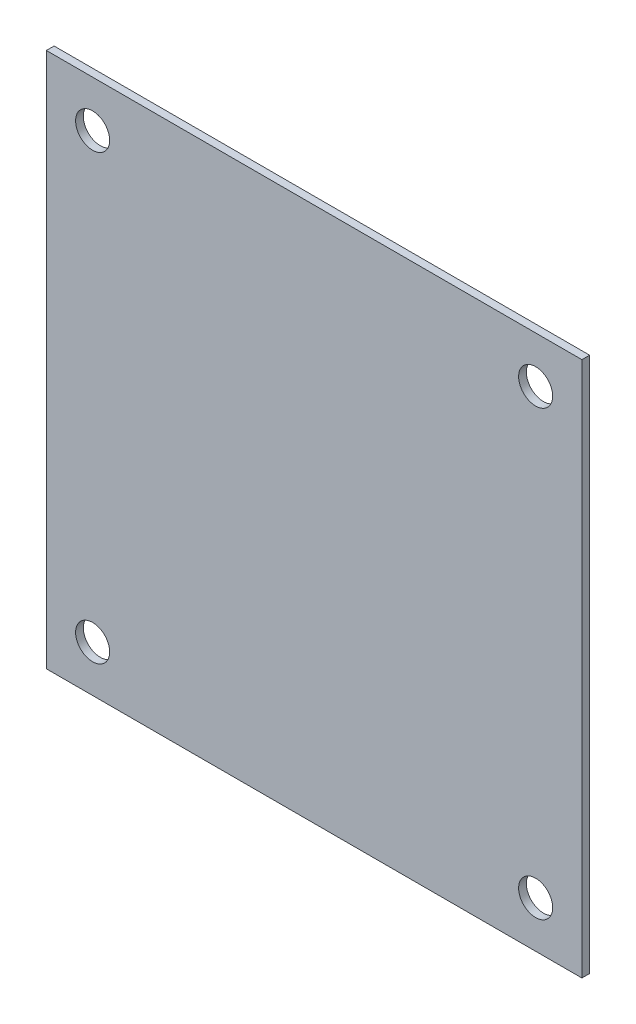
ISO-10303-21;
HEADER;
FILE_DESCRIPTION(('STEP AP214'),'2;1');
FILE_NAME('part.step','',(''),(''),'','','');
FILE_SCHEMA(('AUTOMOTIVE_DESIGN { 1 0 10303 214 1 1 1 1 }'));
ENDSEC;
DATA;
#1=APPLICATION_CONTEXT('core data for automotive mechanical design processes');
#2=APPLICATION_PROTOCOL_DEFINITION('international standard','automotive_design',2000,#1);
#3=PRODUCT_CONTEXT('',#1,'mechanical');
#4=PRODUCT('Part','Part','',(#3));
#5=PRODUCT_RELATED_PRODUCT_CATEGORY('part','',(#4));
#6=PRODUCT_DEFINITION_FORMATION('','',#4);
#7=PRODUCT_DEFINITION_CONTEXT('part definition',#1,'design');
#8=PRODUCT_DEFINITION('design','',#6,#7);
#9=PRODUCT_DEFINITION_SHAPE('','',#8);
#10=(LENGTH_UNIT() NAMED_UNIT(*) SI_UNIT(.MILLI.,.METRE.));
#11=(NAMED_UNIT(*) PLANE_ANGLE_UNIT() SI_UNIT($,.RADIAN.));
#12=(NAMED_UNIT(*) SI_UNIT($,.STERADIAN.) SOLID_ANGLE_UNIT());
#13=UNCERTAINTY_MEASURE_WITH_UNIT(LENGTH_MEASURE(1.E-05),#10,'distance_accuracy_value','');
#14=(GEOMETRIC_REPRESENTATION_CONTEXT(3) GLOBAL_UNCERTAINTY_ASSIGNED_CONTEXT((#13)) GLOBAL_UNIT_ASSIGNED_CONTEXT((#10,
#11,#12)) REPRESENTATION_CONTEXT('',''));
#15=CARTESIAN_POINT('',(0.,0.,0.));
#16=DIRECTION('',(0.,0.,1.));
#17=DIRECTION('',(1.,0.,0.));
#18=AXIS2_PLACEMENT_3D('',#15,#16,#17);
#19=CARTESIAN_POINT('',(0.,0.,1.5875));
#20=DIRECTION('',(0.,0.,-1.));
#21=DIRECTION('',(-1.,0.,0.));
#22=AXIS2_PLACEMENT_3D('',#19,#20,#21);
#23=PLANE('',#22);
#24=DIRECTION('',(1.,0.,0.));
#25=VECTOR('',#24,1.);
#26=CARTESIAN_POINT('',(93.5,-16.5,1.5875));
#27=LINE('',#26,#25);
#28=CARTESIAN_POINT('',(-16.5,-16.5,1.5875));
#29=VERTEX_POINT('',#28);
#30=CARTESIAN_POINT('',(93.5,-16.5,1.5875));
#31=VERTEX_POINT('',#30);
#32=EDGE_CURVE('E84',#29,#31,#27,.T.);
#33=ORIENTED_EDGE('',*,*,#32,.T.);
#34=DIRECTION('',(0.,1.,0.));
#35=VECTOR('',#34,1.);
#36=CARTESIAN_POINT('',(93.5,93.5,1.5875));
#37=LINE('',#36,#35);
#38=CARTESIAN_POINT('',(93.5,93.5,1.5875));
#39=VERTEX_POINT('',#38);
#40=EDGE_CURVE('E79',#31,#39,#37,.T.);
#41=ORIENTED_EDGE('',*,*,#40,.T.);
#42=DIRECTION('',(-1.,0.,0.));
#43=VECTOR('',#42,1.);
#44=CARTESIAN_POINT('',(-16.5,93.5,1.5875));
#45=LINE('',#44,#43);
#46=CARTESIAN_POINT('',(-16.5,93.5,1.5875));
#47=VERTEX_POINT('',#46);
#48=EDGE_CURVE('E82',#39,#47,#45,.T.);
#49=ORIENTED_EDGE('',*,*,#48,.T.);
#50=DIRECTION('',(0.,-1.,0.));
#51=VECTOR('',#50,1.);
#52=CARTESIAN_POINT('',(-16.5,-16.5,1.5875));
#53=LINE('',#52,#51);
#54=EDGE_CURVE('E49',#47,#29,#53,.T.);
#55=ORIENTED_EDGE('',*,*,#54,.T.);
#56=EDGE_LOOP('',(#33,#41,#49,#55));
#57=FACE_BOUND('',#56,.T.);
#58=CARTESIAN_POINT('',(84.,84.,1.5875));
#59=DIRECTION('',(0.,0.,1.));
#60=DIRECTION('',(1.,0.,0.));
#61=AXIS2_PLACEMENT_3D('',#58,#59,#60);
#62=CIRCLE('',#61,3.5);
#63=CARTESIAN_POINT('',(87.5,84.,1.5875));
#64=VERTEX_POINT('',#63);
#65=EDGE_CURVE('E99',#64,#64,#62,.T.);
#66=ORIENTED_EDGE('',*,*,#65,.F.);
#67=EDGE_LOOP('',(#66));
#68=FACE_BOUND('',#67,.T.);
#69=CARTESIAN_POINT('',(-7.00000000000002,84.,1.5875));
#70=DIRECTION('',(0.,0.,1.));
#71=DIRECTION('',(1.,0.,0.));
#72=AXIS2_PLACEMENT_3D('',#69,#70,#71);
#73=CIRCLE('',#72,3.5);
#74=CARTESIAN_POINT('',(-3.50000000000002,84.,1.5875));
#75=VERTEX_POINT('',#74);
#76=EDGE_CURVE('E114',#75,#75,#73,.T.);
#77=ORIENTED_EDGE('',*,*,#76,.F.);
#78=EDGE_LOOP('',(#77));
#79=FACE_BOUND('',#78,.T.);
#80=CARTESIAN_POINT('',(-7.,-7.,1.5875));
#81=DIRECTION('',(0.,0.,1.));
#82=DIRECTION('',(1.,0.,0.));
#83=AXIS2_PLACEMENT_3D('',#80,#81,#82);
#84=CIRCLE('',#83,3.5);
#85=CARTESIAN_POINT('',(-3.5,-7.,1.5875));
#86=VERTEX_POINT('',#85);
#87=EDGE_CURVE('E120',#86,#86,#84,.T.);
#88=ORIENTED_EDGE('',*,*,#87,.F.);
#89=EDGE_LOOP('',(#88));
#90=FACE_BOUND('',#89,.T.);
#91=CARTESIAN_POINT('',(84.,-7.,1.5875));
#92=DIRECTION('',(0.,0.,1.));
#93=DIRECTION('',(1.,0.,0.));
#94=AXIS2_PLACEMENT_3D('',#91,#92,#93);
#95=CIRCLE('',#94,3.5);
#96=CARTESIAN_POINT('',(87.5,-7.,1.5875));
#97=VERTEX_POINT('',#96);
#98=EDGE_CURVE('E126',#97,#97,#95,.T.);
#99=ORIENTED_EDGE('',*,*,#98,.F.);
#100=EDGE_LOOP('',(#99));
#101=FACE_BOUND('',#100,.T.);
#102=ADVANCED_FACE('F32',(#57,#68,#79,#90,#101),#23,.F.);
#103=CARTESIAN_POINT('',(0.,0.,0.));
#104=DIRECTION('',(0.,0.,-1.));
#105=DIRECTION('',(-1.,0.,0.));
#106=AXIS2_PLACEMENT_3D('',#103,#104,#105);
#107=PLANE('',#106);
#108=CARTESIAN_POINT('',(-7.,-7.,0.));
#109=DIRECTION('',(0.,0.,1.));
#110=DIRECTION('',(1.,0.,0.));
#111=AXIS2_PLACEMENT_3D('',#108,#109,#110);
#112=CIRCLE('',#111,3.5);
#113=CARTESIAN_POINT('',(-3.5,-7.,0.));
#114=VERTEX_POINT('',#113);
#115=EDGE_CURVE('E123',#114,#114,#112,.T.);
#116=ORIENTED_EDGE('',*,*,#115,.T.);
#117=EDGE_LOOP('',(#116));
#118=FACE_BOUND('',#117,.T.);
#119=CARTESIAN_POINT('',(84.,84.,0.));
#120=DIRECTION('',(0.,0.,1.));
#121=DIRECTION('',(1.,0.,0.));
#122=AXIS2_PLACEMENT_3D('',#119,#120,#121);
#123=CIRCLE('',#122,3.5);
#124=CARTESIAN_POINT('',(87.5,84.,0.));
#125=VERTEX_POINT('',#124);
#126=EDGE_CURVE('E111',#125,#125,#123,.T.);
#127=ORIENTED_EDGE('',*,*,#126,.T.);
#128=EDGE_LOOP('',(#127));
#129=FACE_BOUND('',#128,.T.);
#130=DIRECTION('',(1.,0.,0.));
#131=VECTOR('',#130,1.);
#132=CARTESIAN_POINT('',(93.5,-16.5,0.));
#133=LINE('',#132,#131);
#134=CARTESIAN_POINT('',(-16.5,-16.5,0.));
#135=VERTEX_POINT('',#134);
#136=CARTESIAN_POINT('',(93.5,-16.5,0.));
#137=VERTEX_POINT('',#136);
#138=EDGE_CURVE('E96',#135,#137,#133,.T.);
#139=ORIENTED_EDGE('',*,*,#138,.F.);
#140=DIRECTION('',(0.,-1.,0.));
#141=VECTOR('',#140,1.);
#142=CARTESIAN_POINT('',(-16.5,-16.5,0.));
#143=LINE('',#142,#141);
#144=CARTESIAN_POINT('',(-16.5,93.5,0.));
#145=VERTEX_POINT('',#144);
#146=EDGE_CURVE('E72',#145,#135,#143,.T.);
#147=ORIENTED_EDGE('',*,*,#146,.F.);
#148=DIRECTION('',(-1.,0.,0.));
#149=VECTOR('',#148,1.);
#150=CARTESIAN_POINT('',(-16.5,93.5,0.));
#151=LINE('',#150,#149);
#152=CARTESIAN_POINT('',(93.5,93.5,0.));
#153=VERTEX_POINT('',#152);
#154=EDGE_CURVE('E66',#153,#145,#151,.T.);
#155=ORIENTED_EDGE('',*,*,#154,.F.);
#156=DIRECTION('',(0.,1.,0.));
#157=VECTOR('',#156,1.);
#158=CARTESIAN_POINT('',(93.5,93.5,0.));
#159=LINE('',#158,#157);
#160=EDGE_CURVE('E88',#137,#153,#159,.T.);
#161=ORIENTED_EDGE('',*,*,#160,.F.);
#162=EDGE_LOOP('',(#139,#147,#155,#161));
#163=FACE_BOUND('',#162,.T.);
#164=CARTESIAN_POINT('',(-7.00000000000002,84.,0.));
#165=DIRECTION('',(0.,0.,1.));
#166=DIRECTION('',(1.,0.,0.));
#167=AXIS2_PLACEMENT_3D('',#164,#165,#166);
#168=CIRCLE('',#167,3.5);
#169=CARTESIAN_POINT('',(-3.50000000000002,84.,0.));
#170=VERTEX_POINT('',#169);
#171=EDGE_CURVE('E117',#170,#170,#168,.T.);
#172=ORIENTED_EDGE('',*,*,#171,.T.);
#173=EDGE_LOOP('',(#172));
#174=FACE_BOUND('',#173,.T.);
#175=CARTESIAN_POINT('',(84.,-7.,0.));
#176=DIRECTION('',(0.,0.,1.));
#177=DIRECTION('',(1.,0.,0.));
#178=AXIS2_PLACEMENT_3D('',#175,#176,#177);
#179=CIRCLE('',#178,3.5);
#180=CARTESIAN_POINT('',(87.5,-7.,0.));
#181=VERTEX_POINT('',#180);
#182=EDGE_CURVE('E129',#181,#181,#179,.T.);
#183=ORIENTED_EDGE('',*,*,#182,.T.);
#184=EDGE_LOOP('',(#183));
#185=FACE_BOUND('',#184,.T.);
#186=ADVANCED_FACE('F107',(#118,#129,#163,#174,#185),#107,.T.);
#187=CARTESIAN_POINT('',(93.5,-16.5,1.5875));
#188=DIRECTION('',(0.,1.,0.));
#189=DIRECTION('',(0.,0.,1.));
#190=AXIS2_PLACEMENT_3D('',#187,#188,#189);
#191=PLANE('',#190);
#192=ORIENTED_EDGE('',*,*,#138,.T.);
#193=DIRECTION('',(0.,0.,-1.));
#194=VECTOR('',#193,1.);
#195=CARTESIAN_POINT('',(93.5,-16.5,1.5875));
#196=LINE('',#195,#194);
#197=EDGE_CURVE('E11',#31,#137,#196,.T.);
#198=ORIENTED_EDGE('',*,*,#197,.F.);
#199=ORIENTED_EDGE('',*,*,#32,.F.);
#200=DIRECTION('',(0.,0.,-1.));
#201=VECTOR('',#200,1.);
#202=CARTESIAN_POINT('',(-16.5,-16.5,1.5875));
#203=LINE('',#202,#201);
#204=EDGE_CURVE('E92',#29,#135,#203,.T.);
#205=ORIENTED_EDGE('',*,*,#204,.T.);
#206=EDGE_LOOP('',(#192,#198,#199,#205));
#207=FACE_BOUND('',#206,.T.);
#208=ADVANCED_FACE('F34',(#207),#191,.F.);
#209=CARTESIAN_POINT('',(93.5,93.5,1.5875));
#210=DIRECTION('',(-1.,0.,0.));
#211=DIRECTION('',(0.,0.,1.));
#212=AXIS2_PLACEMENT_3D('',#209,#210,#211);
#213=PLANE('',#212);
#214=ORIENTED_EDGE('',*,*,#160,.T.);
#215=DIRECTION('',(0.,0.,-1.));
#216=VECTOR('',#215,1.);
#217=CARTESIAN_POINT('',(93.5,93.5,1.5875));
#218=LINE('',#217,#216);
#219=EDGE_CURVE('E41',#39,#153,#218,.T.);
#220=ORIENTED_EDGE('',*,*,#219,.F.);
#221=ORIENTED_EDGE('',*,*,#40,.F.);
#222=ORIENTED_EDGE('',*,*,#197,.T.);
#223=EDGE_LOOP('',(#214,#220,#221,#222));
#224=FACE_BOUND('',#223,.T.);
#225=ADVANCED_FACE('F87',(#224),#213,.F.);
#226=CARTESIAN_POINT('',(-16.5,93.5,1.5875));
#227=DIRECTION('',(0.,-1.,0.));
#228=DIRECTION('',(0.,0.,-1.));
#229=AXIS2_PLACEMENT_3D('',#226,#227,#228);
#230=PLANE('',#229);
#231=ORIENTED_EDGE('',*,*,#154,.T.);
#232=DIRECTION('',(0.,0.,-1.));
#233=VECTOR('',#232,1.);
#234=CARTESIAN_POINT('',(-16.5,93.5,1.5875));
#235=LINE('',#234,#233);
#236=EDGE_CURVE('E89',#47,#145,#235,.T.);
#237=ORIENTED_EDGE('',*,*,#236,.F.);
#238=ORIENTED_EDGE('',*,*,#48,.F.);
#239=ORIENTED_EDGE('',*,*,#219,.T.);
#240=EDGE_LOOP('',(#231,#237,#238,#239));
#241=FACE_BOUND('',#240,.T.);
#242=ADVANCED_FACE('F90',(#241),#230,.F.);
#243=CARTESIAN_POINT('',(-16.5,-16.5,1.5875));
#244=DIRECTION('',(1.,0.,0.));
#245=DIRECTION('',(0.,0.,-1.));
#246=AXIS2_PLACEMENT_3D('',#243,#244,#245);
#247=PLANE('',#246);
#248=ORIENTED_EDGE('',*,*,#146,.T.);
#249=ORIENTED_EDGE('',*,*,#204,.F.);
#250=ORIENTED_EDGE('',*,*,#54,.F.);
#251=ORIENTED_EDGE('',*,*,#236,.T.);
#252=EDGE_LOOP('',(#248,#249,#250,#251));
#253=FACE_BOUND('',#252,.T.);
#254=ADVANCED_FACE('F104',(#253),#247,.F.);
#255=CARTESIAN_POINT('',(84.,84.,1.5875));
#256=DIRECTION('',(0.,0.,-1.));
#257=DIRECTION('',(-1.,0.,0.));
#258=AXIS2_PLACEMENT_3D('',#255,#256,#257);
#259=CYLINDRICAL_SURFACE('',#258,3.5);
#260=ORIENTED_EDGE('',*,*,#65,.T.);
#261=EDGE_LOOP('',(#260));
#262=FACE_BOUND('',#261,.T.);
#263=ORIENTED_EDGE('',*,*,#126,.F.);
#264=EDGE_LOOP('',(#263));
#265=FACE_BOUND('',#264,.T.);
#266=ADVANCED_FACE('F146',(#262,#265),#259,.F.);
#267=CARTESIAN_POINT('',(-7.00000000000002,84.,1.5875));
#268=DIRECTION('',(0.,0.,-1.));
#269=DIRECTION('',(-1.,0.,0.));
#270=AXIS2_PLACEMENT_3D('',#267,#268,#269);
#271=CYLINDRICAL_SURFACE('',#270,3.5);
#272=ORIENTED_EDGE('',*,*,#76,.T.);
#273=EDGE_LOOP('',(#272));
#274=FACE_BOUND('',#273,.T.);
#275=ORIENTED_EDGE('',*,*,#171,.F.);
#276=EDGE_LOOP('',(#275));
#277=FACE_BOUND('',#276,.T.);
#278=ADVANCED_FACE('F192',(#274,#277),#271,.F.);
#279=CARTESIAN_POINT('',(-7.,-7.,1.5875));
#280=DIRECTION('',(0.,0.,-1.));
#281=DIRECTION('',(-1.,0.,0.));
#282=AXIS2_PLACEMENT_3D('',#279,#280,#281);
#283=CYLINDRICAL_SURFACE('',#282,3.5);
#284=ORIENTED_EDGE('',*,*,#87,.T.);
#285=EDGE_LOOP('',(#284));
#286=FACE_BOUND('',#285,.T.);
#287=ORIENTED_EDGE('',*,*,#115,.F.);
#288=EDGE_LOOP('',(#287));
#289=FACE_BOUND('',#288,.T.);
#290=ADVANCED_FACE('F200',(#286,#289),#283,.F.);
#291=CARTESIAN_POINT('',(84.,-7.,1.5875));
#292=DIRECTION('',(0.,0.,-1.));
#293=DIRECTION('',(-1.,0.,0.));
#294=AXIS2_PLACEMENT_3D('',#291,#292,#293);
#295=CYLINDRICAL_SURFACE('',#294,3.5);
#296=ORIENTED_EDGE('',*,*,#98,.T.);
#297=EDGE_LOOP('',(#296));
#298=FACE_BOUND('',#297,.T.);
#299=ORIENTED_EDGE('',*,*,#182,.F.);
#300=EDGE_LOOP('',(#299));
#301=FACE_BOUND('',#300,.T.);
#302=ADVANCED_FACE('F135',(#298,#301),#295,.F.);
#303=CLOSED_SHELL('',(#102,#186,#208,#225,#242,#254,#266,#278,#290,#302));
#304=MANIFOLD_SOLID_BREP('B2',#303);
#305=ADVANCED_BREP_SHAPE_REPRESENTATION('',(#18,#304),#14);
#306=SHAPE_DEFINITION_REPRESENTATION(#9,#305);
ENDSEC;
END-ISO-10303-21;
